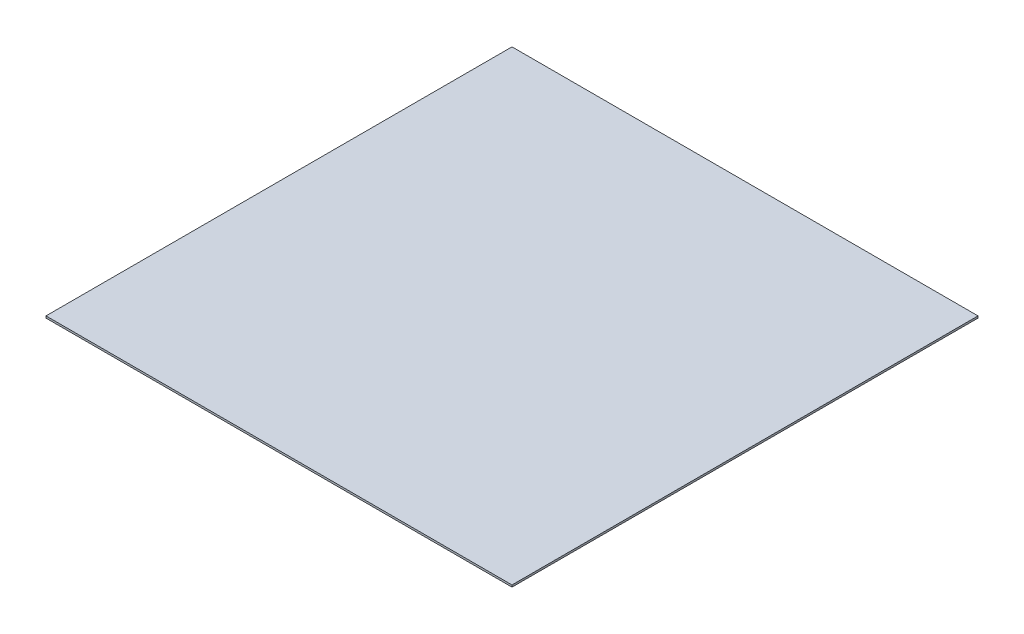
ISO-10303-21;
HEADER;
FILE_DESCRIPTION(('STEP AP214'),'2;1');
FILE_NAME('part.step','',(''),(''),'','','');
FILE_SCHEMA(('AUTOMOTIVE_DESIGN { 1 0 10303 214 1 1 1 1 }'));
ENDSEC;
DATA;
#1=APPLICATION_CONTEXT('core data for automotive mechanical design processes');
#2=APPLICATION_PROTOCOL_DEFINITION('international standard','automotive_design',2000,#1);
#3=PRODUCT_CONTEXT('',#1,'mechanical');
#4=PRODUCT('Part','Part','',(#3));
#5=PRODUCT_RELATED_PRODUCT_CATEGORY('part','',(#4));
#6=PRODUCT_DEFINITION_FORMATION('','',#4);
#7=PRODUCT_DEFINITION_CONTEXT('part definition',#1,'design');
#8=PRODUCT_DEFINITION('design','',#6,#7);
#9=PRODUCT_DEFINITION_SHAPE('','',#8);
#10=(LENGTH_UNIT() NAMED_UNIT(*) SI_UNIT(.MILLI.,.METRE.));
#11=(NAMED_UNIT(*) PLANE_ANGLE_UNIT() SI_UNIT($,.RADIAN.));
#12=(NAMED_UNIT(*) SI_UNIT($,.STERADIAN.) SOLID_ANGLE_UNIT());
#13=UNCERTAINTY_MEASURE_WITH_UNIT(LENGTH_MEASURE(1.E-05),#10,'distance_accuracy_value','');
#14=(GEOMETRIC_REPRESENTATION_CONTEXT(3) GLOBAL_UNCERTAINTY_ASSIGNED_CONTEXT((#13)) GLOBAL_UNIT_ASSIGNED_CONTEXT((#10,
#11,#12)) REPRESENTATION_CONTEXT('',''));
#15=CARTESIAN_POINT('',(0.,0.,0.));
#16=DIRECTION('',(0.,0.,1.));
#17=DIRECTION('',(1.,0.,0.));
#18=AXIS2_PLACEMENT_3D('',#15,#16,#17);
#19=CARTESIAN_POINT('',(-6000.,50.,6000.));
#20=DIRECTION('',(1.,0.,0.));
#21=DIRECTION('',(0.,0.,-1.));
#22=AXIS2_PLACEMENT_3D('',#19,#20,#21);
#23=PLANE('',#22);
#24=DIRECTION('',(0.,0.,1.));
#25=VECTOR('',#24,1.);
#26=CARTESIAN_POINT('',(-6000.,0.,6000.));
#27=LINE('',#26,#25);
#28=CARTESIAN_POINT('',(-6000.,0.,-6000.));
#29=VERTEX_POINT('',#28);
#30=CARTESIAN_POINT('',(-6000.,0.,6000.));
#31=VERTEX_POINT('',#30);
#32=EDGE_CURVE('E96',#29,#31,#27,.T.);
#33=ORIENTED_EDGE('',*,*,#32,.T.);
#34=DIRECTION('',(0.,-1.,0.));
#35=VECTOR('',#34,1.);
#36=CARTESIAN_POINT('',(-6000.,50.,6000.));
#37=LINE('',#36,#35);
#38=CARTESIAN_POINT('',(-6000.,50.,6000.));
#39=VERTEX_POINT('',#38);
#40=EDGE_CURVE('E11',#39,#31,#37,.T.);
#41=ORIENTED_EDGE('',*,*,#40,.F.);
#42=DIRECTION('',(0.,0.,1.));
#43=VECTOR('',#42,1.);
#44=CARTESIAN_POINT('',(-6000.,50.,6000.));
#45=LINE('',#44,#43);
#46=CARTESIAN_POINT('',(-6000.,50.,-6000.));
#47=VERTEX_POINT('',#46);
#48=EDGE_CURVE('E84',#47,#39,#45,.T.);
#49=ORIENTED_EDGE('',*,*,#48,.F.);
#50=DIRECTION('',(0.,-1.,0.));
#51=VECTOR('',#50,1.);
#52=CARTESIAN_POINT('',(-6000.,50.,-6000.));
#53=LINE('',#52,#51);
#54=EDGE_CURVE('E92',#47,#29,#53,.T.);
#55=ORIENTED_EDGE('',*,*,#54,.T.);
#56=EDGE_LOOP('',(#33,#41,#49,#55));
#57=FACE_BOUND('',#56,.T.);
#58=ADVANCED_FACE('F33',(#57),#23,.F.);
#59=CARTESIAN_POINT('',(6000.,50.,6000.));
#60=DIRECTION('',(0.,0.,-1.));
#61=DIRECTION('',(-1.,0.,0.));
#62=AXIS2_PLACEMENT_3D('',#59,#60,#61);
#63=PLANE('',#62);
#64=DIRECTION('',(1.,0.,0.));
#65=VECTOR('',#64,1.);
#66=CARTESIAN_POINT('',(6000.,0.,6000.));
#67=LINE('',#66,#65);
#68=CARTESIAN_POINT('',(6000.,0.,6000.));
#69=VERTEX_POINT('',#68);
#70=EDGE_CURVE('E88',#31,#69,#67,.T.);
#71=ORIENTED_EDGE('',*,*,#70,.T.);
#72=DIRECTION('',(0.,-1.,0.));
#73=VECTOR('',#72,1.);
#74=CARTESIAN_POINT('',(6000.,50.,6000.));
#75=LINE('',#74,#73);
#76=CARTESIAN_POINT('',(6000.,50.,6000.));
#77=VERTEX_POINT('',#76);
#78=EDGE_CURVE('E41',#77,#69,#75,.T.);
#79=ORIENTED_EDGE('',*,*,#78,.F.);
#80=DIRECTION('',(1.,0.,0.));
#81=VECTOR('',#80,1.);
#82=CARTESIAN_POINT('',(6000.,50.,6000.));
#83=LINE('',#82,#81);
#84=EDGE_CURVE('E79',#39,#77,#83,.T.);
#85=ORIENTED_EDGE('',*,*,#84,.F.);
#86=ORIENTED_EDGE('',*,*,#40,.T.);
#87=EDGE_LOOP('',(#71,#79,#85,#86));
#88=FACE_BOUND('',#87,.T.);
#89=ADVANCED_FACE('F87',(#88),#63,.F.);
#90=CARTESIAN_POINT('',(6000.,50.,6000.));
#91=DIRECTION('',(-1.,0.,0.));
#92=DIRECTION('',(0.,0.,1.));
#93=AXIS2_PLACEMENT_3D('',#90,#91,#92);
#94=PLANE('',#93);
#95=DIRECTION('',(0.,0.,-1.));
#96=VECTOR('',#95,1.);
#97=CARTESIAN_POINT('',(6000.,0.,6000.));
#98=LINE('',#97,#96);
#99=CARTESIAN_POINT('',(6000.,0.,-6000.));
#100=VERTEX_POINT('',#99);
#101=EDGE_CURVE('E66',#69,#100,#98,.T.);
#102=ORIENTED_EDGE('',*,*,#101,.T.);
#103=DIRECTION('',(0.,-1.,0.));
#104=VECTOR('',#103,1.);
#105=CARTESIAN_POINT('',(6000.,50.,-6000.));
#106=LINE('',#105,#104);
#107=CARTESIAN_POINT('',(6000.,50.,-6000.));
#108=VERTEX_POINT('',#107);
#109=EDGE_CURVE('E89',#108,#100,#106,.T.);
#110=ORIENTED_EDGE('',*,*,#109,.F.);
#111=DIRECTION('',(0.,0.,-1.));
#112=VECTOR('',#111,1.);
#113=CARTESIAN_POINT('',(6000.,50.,6000.));
#114=LINE('',#113,#112);
#115=EDGE_CURVE('E82',#77,#108,#114,.T.);
#116=ORIENTED_EDGE('',*,*,#115,.F.);
#117=ORIENTED_EDGE('',*,*,#78,.T.);
#118=EDGE_LOOP('',(#102,#110,#116,#117));
#119=FACE_BOUND('',#118,.T.);
#120=ADVANCED_FACE('F90',(#119),#94,.F.);
#121=CARTESIAN_POINT('',(6000.,50.,-6000.));
#122=DIRECTION('',(0.,0.,1.));
#123=DIRECTION('',(1.,0.,0.));
#124=AXIS2_PLACEMENT_3D('',#121,#122,#123);
#125=PLANE('',#124);
#126=DIRECTION('',(-1.,0.,0.));
#127=VECTOR('',#126,1.);
#128=CARTESIAN_POINT('',(6000.,0.,-6000.));
#129=LINE('',#128,#127);
#130=EDGE_CURVE('E72',#100,#29,#129,.T.);
#131=ORIENTED_EDGE('',*,*,#130,.T.);
#132=ORIENTED_EDGE('',*,*,#54,.F.);
#133=DIRECTION('',(-1.,0.,0.));
#134=VECTOR('',#133,1.);
#135=CARTESIAN_POINT('',(6000.,50.,-6000.));
#136=LINE('',#135,#134);
#137=EDGE_CURVE('E49',#108,#47,#136,.T.);
#138=ORIENTED_EDGE('',*,*,#137,.F.);
#139=ORIENTED_EDGE('',*,*,#109,.T.);
#140=EDGE_LOOP('',(#131,#132,#138,#139));
#141=FACE_BOUND('',#140,.T.);
#142=ADVANCED_FACE('F103',(#141),#125,.F.);
#143=CARTESIAN_POINT('',(0.,50.,0.));
#144=DIRECTION('',(0.,1.,0.));
#145=DIRECTION('',(0.,0.,1.));
#146=AXIS2_PLACEMENT_3D('',#143,#144,#145);
#147=PLANE('',#146);
#148=ORIENTED_EDGE('',*,*,#48,.T.);
#149=ORIENTED_EDGE('',*,*,#84,.T.);
#150=ORIENTED_EDGE('',*,*,#115,.T.);
#151=ORIENTED_EDGE('',*,*,#137,.T.);
#152=EDGE_LOOP('',(#148,#149,#150,#151));
#153=FACE_BOUND('',#152,.T.);
#154=ADVANCED_FACE('F80',(#153),#147,.T.);
#155=CARTESIAN_POINT('',(0.,0.,0.));
#156=DIRECTION('',(0.,1.,0.));
#157=DIRECTION('',(0.,0.,1.));
#158=AXIS2_PLACEMENT_3D('',#155,#156,#157);
#159=PLANE('',#158);
#160=ORIENTED_EDGE('',*,*,#32,.F.);
#161=ORIENTED_EDGE('',*,*,#130,.F.);
#162=ORIENTED_EDGE('',*,*,#101,.F.);
#163=ORIENTED_EDGE('',*,*,#70,.F.);
#164=EDGE_LOOP('',(#160,#161,#162,#163));
#165=FACE_BOUND('',#164,.T.);
#166=ADVANCED_FACE('F106',(#165),#159,.F.);
#167=CLOSED_SHELL('',(#58,#89,#120,#142,#154,#166));
#168=MANIFOLD_SOLID_BREP('B2',#167);
#169=ADVANCED_BREP_SHAPE_REPRESENTATION('',(#18,#168),#14);
#170=SHAPE_DEFINITION_REPRESENTATION(#9,#169);
ENDSEC;
END-ISO-10303-21;
